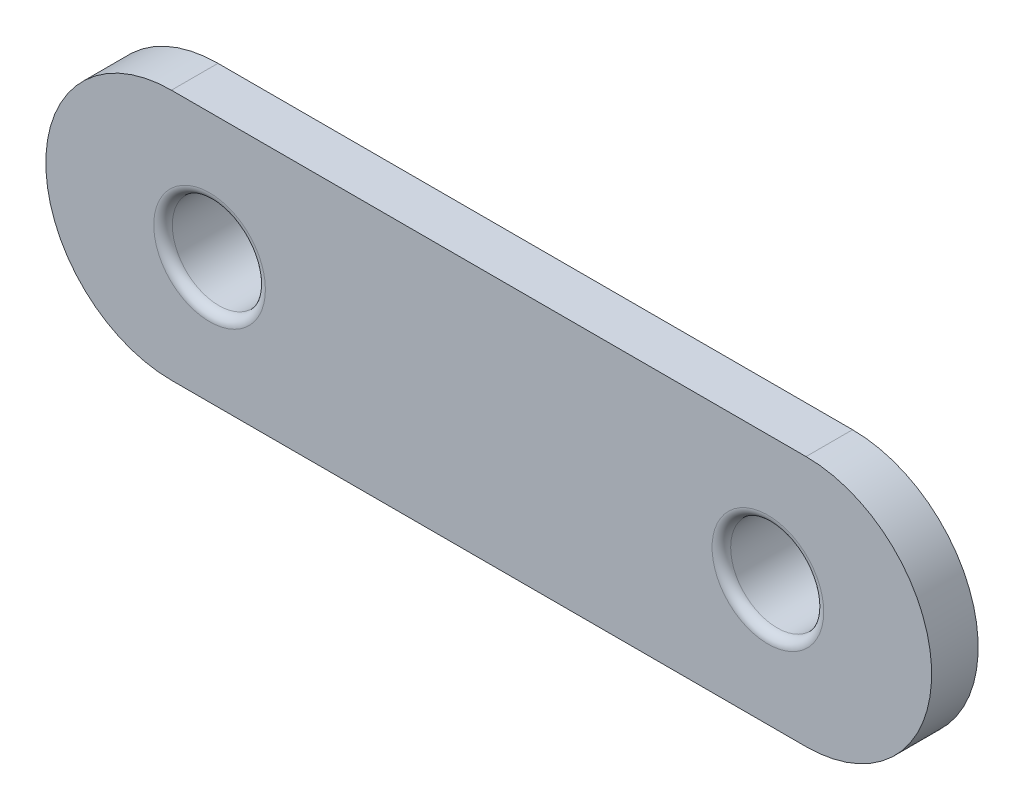
ISO-10303-21;
HEADER;
FILE_DESCRIPTION(('STEP AP214'),'2;1');
FILE_NAME('part.step','',(''),(''),'','','');
FILE_SCHEMA(('AUTOMOTIVE_DESIGN { 1 0 10303 214 1 1 1 1 }'));
ENDSEC;
DATA;
#1=APPLICATION_CONTEXT('core data for automotive mechanical design processes');
#2=APPLICATION_PROTOCOL_DEFINITION('international standard','automotive_design',2000,#1);
#3=PRODUCT_CONTEXT('',#1,'mechanical');
#4=PRODUCT('Part','Part','',(#3));
#5=PRODUCT_RELATED_PRODUCT_CATEGORY('part','',(#4));
#6=PRODUCT_DEFINITION_FORMATION('','',#4);
#7=PRODUCT_DEFINITION_CONTEXT('part definition',#1,'design');
#8=PRODUCT_DEFINITION('design','',#6,#7);
#9=PRODUCT_DEFINITION_SHAPE('','',#8);
#10=(LENGTH_UNIT() NAMED_UNIT(*) SI_UNIT(.MILLI.,.METRE.));
#11=(NAMED_UNIT(*) PLANE_ANGLE_UNIT() SI_UNIT($,.RADIAN.));
#12=(NAMED_UNIT(*) SI_UNIT($,.STERADIAN.) SOLID_ANGLE_UNIT());
#13=UNCERTAINTY_MEASURE_WITH_UNIT(LENGTH_MEASURE(1.E-05),#10,'distance_accuracy_value','');
#14=(GEOMETRIC_REPRESENTATION_CONTEXT(3) GLOBAL_UNCERTAINTY_ASSIGNED_CONTEXT((#13)) GLOBAL_UNIT_ASSIGNED_CONTEXT((#10,
#11,#12)) REPRESENTATION_CONTEXT('',''));
#15=CARTESIAN_POINT('',(0.,0.,0.));
#16=DIRECTION('',(0.,0.,1.));
#17=DIRECTION('',(1.,0.,0.));
#18=AXIS2_PLACEMENT_3D('',#15,#16,#17);
#19=CARTESIAN_POINT('',(-17.05,0.,0.));
#20=DIRECTION('',(0.,0.,1.));
#21=DIRECTION('',(1.,0.,0.));
#22=AXIS2_PLACEMENT_3D('',#19,#20,#21);
#23=PLANE('',#22);
#24=CARTESIAN_POINT('',(15.,0.,0.));
#25=DIRECTION('',(0.,0.,1.));
#26=DIRECTION('',(1.,0.,0.));
#27=AXIS2_PLACEMENT_3D('',#24,#25,#26);
#28=CIRCLE('',#27,3.5);
#29=CARTESIAN_POINT('',(18.5,0.,0.));
#30=VERTEX_POINT('',#29);
#31=EDGE_CURVE('E94',#30,#30,#28,.F.);
#32=ORIENTED_EDGE('',*,*,#31,.F.);
#33=EDGE_LOOP('',(#32));
#34=FACE_BOUND('',#33,.T.);
#35=CARTESIAN_POINT('',(-17.05,0.,0.));
#36=DIRECTION('',(0.,0.,1.));
#37=DIRECTION('',(1.,0.,0.));
#38=AXIS2_PLACEMENT_3D('',#35,#36,#37);
#39=CIRCLE('',#38,6.75);
#40=CARTESIAN_POINT('',(-17.05,6.75,0.));
#41=VERTEX_POINT('',#40);
#42=CARTESIAN_POINT('',(-17.05,-6.75,0.));
#43=VERTEX_POINT('',#42);
#44=EDGE_CURVE('E84',#41,#43,#39,.T.);
#45=ORIENTED_EDGE('',*,*,#44,.F.);
#46=DIRECTION('',(-1.,0.,0.));
#47=VECTOR('',#46,1.);
#48=CARTESIAN_POINT('',(-17.05,6.75,0.));
#49=LINE('',#48,#47);
#50=CARTESIAN_POINT('',(17.05,6.75,0.));
#51=VERTEX_POINT('',#50);
#52=EDGE_CURVE('E56',#51,#41,#49,.T.);
#53=ORIENTED_EDGE('',*,*,#52,.F.);
#54=CARTESIAN_POINT('',(17.05,0.,0.));
#55=DIRECTION('',(0.,0.,1.));
#56=DIRECTION('',(1.,0.,0.));
#57=AXIS2_PLACEMENT_3D('',#54,#55,#56);
#58=CIRCLE('',#57,6.75);
#59=CARTESIAN_POINT('',(17.05,-6.75,0.));
#60=VERTEX_POINT('',#59);
#61=EDGE_CURVE('E50',#60,#51,#58,.T.);
#62=ORIENTED_EDGE('',*,*,#61,.F.);
#63=DIRECTION('',(1.,0.,0.));
#64=VECTOR('',#63,1.);
#65=CARTESIAN_POINT('',(-17.05,-6.75,0.));
#66=LINE('',#65,#64);
#67=EDGE_CURVE('E74',#43,#60,#66,.T.);
#68=ORIENTED_EDGE('',*,*,#67,.F.);
#69=EDGE_LOOP('',(#45,#53,#62,#68));
#70=FACE_BOUND('',#69,.T.);
#71=CARTESIAN_POINT('',(-15.,0.,0.));
#72=DIRECTION('',(0.,0.,1.));
#73=DIRECTION('',(1.,0.,0.));
#74=AXIS2_PLACEMENT_3D('',#71,#72,#73);
#75=CIRCLE('',#74,3.5);
#76=CARTESIAN_POINT('',(-11.5,0.,0.));
#77=VERTEX_POINT('',#76);
#78=EDGE_CURVE('E97',#77,#77,#75,.F.);
#79=ORIENTED_EDGE('',*,*,#78,.F.);
#80=EDGE_LOOP('',(#79));
#81=FACE_BOUND('',#80,.T.);
#82=ADVANCED_FACE('F16',(#34,#70,#81),#23,.F.);
#83=CARTESIAN_POINT('',(-17.05,0.,2.5));
#84=DIRECTION('',(0.,0.,1.));
#85=DIRECTION('',(1.,0.,0.));
#86=AXIS2_PLACEMENT_3D('',#83,#84,#85);
#87=PLANE('',#86);
#88=CARTESIAN_POINT('',(15.,0.,2.5));
#89=DIRECTION('',(0.,0.,1.));
#90=DIRECTION('',(1.,0.,0.));
#91=AXIS2_PLACEMENT_3D('',#88,#89,#90);
#92=CIRCLE('',#91,3.);
#93=CARTESIAN_POINT('',(18.,0.,2.5));
#94=VERTEX_POINT('',#93);
#95=EDGE_CURVE('E25',#94,#94,#92,.F.);
#96=ORIENTED_EDGE('',*,*,#95,.T.);
#97=EDGE_LOOP('',(#96));
#98=FACE_BOUND('',#97,.T.);
#99=CARTESIAN_POINT('',(-15.,0.,2.5));
#100=DIRECTION('',(0.,0.,1.));
#101=DIRECTION('',(1.,0.,0.));
#102=AXIS2_PLACEMENT_3D('',#99,#100,#101);
#103=CIRCLE('',#102,3.);
#104=CARTESIAN_POINT('',(-12.,0.,2.5));
#105=VERTEX_POINT('',#104);
#106=EDGE_CURVE('E103',#105,#105,#103,.F.);
#107=ORIENTED_EDGE('',*,*,#106,.T.);
#108=EDGE_LOOP('',(#107));
#109=FACE_BOUND('',#108,.T.);
#110=CARTESIAN_POINT('',(-17.05,0.,2.5));
#111=DIRECTION('',(0.,0.,1.));
#112=DIRECTION('',(1.,0.,0.));
#113=AXIS2_PLACEMENT_3D('',#110,#111,#112);
#114=CIRCLE('',#113,6.75);
#115=CARTESIAN_POINT('',(-17.05,6.75,2.5));
#116=VERTEX_POINT('',#115);
#117=CARTESIAN_POINT('',(-17.05,-6.75,2.5));
#118=VERTEX_POINT('',#117);
#119=EDGE_CURVE('E69',#116,#118,#114,.T.);
#120=ORIENTED_EDGE('',*,*,#119,.T.);
#121=DIRECTION('',(1.,0.,0.));
#122=VECTOR('',#121,1.);
#123=CARTESIAN_POINT('',(-17.05,-6.75,2.5));
#124=LINE('',#123,#122);
#125=CARTESIAN_POINT('',(17.05,-6.75,2.5));
#126=VERTEX_POINT('',#125);
#127=EDGE_CURVE('E64',#118,#126,#124,.T.);
#128=ORIENTED_EDGE('',*,*,#127,.T.);
#129=CARTESIAN_POINT('',(17.05,0.,2.5));
#130=DIRECTION('',(0.,0.,1.));
#131=DIRECTION('',(1.,0.,0.));
#132=AXIS2_PLACEMENT_3D('',#129,#130,#131);
#133=CIRCLE('',#132,6.75);
#134=CARTESIAN_POINT('',(17.05,6.75,2.5));
#135=VERTEX_POINT('',#134);
#136=EDGE_CURVE('E67',#126,#135,#133,.T.);
#137=ORIENTED_EDGE('',*,*,#136,.T.);
#138=DIRECTION('',(-1.,0.,0.));
#139=VECTOR('',#138,1.);
#140=CARTESIAN_POINT('',(-17.05,6.75,2.5));
#141=LINE('',#140,#139);
#142=EDGE_CURVE('E33',#135,#116,#141,.T.);
#143=ORIENTED_EDGE('',*,*,#142,.T.);
#144=EDGE_LOOP('',(#120,#128,#137,#143));
#145=FACE_BOUND('',#144,.T.);
#146=ADVANCED_FACE('F65',(#98,#109,#145),#87,.T.);
#147=CARTESIAN_POINT('',(-17.05,0.,2.5));
#148=DIRECTION('',(0.,0.,-1.));
#149=DIRECTION('',(-1.,0.,0.));
#150=AXIS2_PLACEMENT_3D('',#147,#148,#149);
#151=CYLINDRICAL_SURFACE('',#150,6.75);
#152=ORIENTED_EDGE('',*,*,#44,.T.);
#153=DIRECTION('',(0.,0.,-1.));
#154=VECTOR('',#153,1.);
#155=CARTESIAN_POINT('',(-17.05,-6.75,2.5));
#156=LINE('',#155,#154);
#157=EDGE_CURVE('E75',#118,#43,#156,.T.);
#158=ORIENTED_EDGE('',*,*,#157,.F.);
#159=ORIENTED_EDGE('',*,*,#119,.F.);
#160=DIRECTION('',(0.,0.,-1.));
#161=VECTOR('',#160,1.);
#162=CARTESIAN_POINT('',(-17.05,6.75,2.5));
#163=LINE('',#162,#161);
#164=EDGE_CURVE('E80',#116,#41,#163,.T.);
#165=ORIENTED_EDGE('',*,*,#164,.T.);
#166=EDGE_LOOP('',(#152,#158,#159,#165));
#167=FACE_BOUND('',#166,.T.);
#168=ADVANCED_FACE('F158',(#167),#151,.T.);
#169=CARTESIAN_POINT('',(-17.05,-6.75,2.5));
#170=DIRECTION('',(0.,1.,0.));
#171=DIRECTION('',(0.,0.,1.));
#172=AXIS2_PLACEMENT_3D('',#169,#170,#171);
#173=PLANE('',#172);
#174=ORIENTED_EDGE('',*,*,#67,.T.);
#175=DIRECTION('',(0.,0.,-1.));
#176=VECTOR('',#175,1.);
#177=CARTESIAN_POINT('',(17.05,-6.75,2.5));
#178=LINE('',#177,#176);
#179=EDGE_CURVE('E72',#126,#60,#178,.T.);
#180=ORIENTED_EDGE('',*,*,#179,.F.);
#181=ORIENTED_EDGE('',*,*,#127,.F.);
#182=ORIENTED_EDGE('',*,*,#157,.T.);
#183=EDGE_LOOP('',(#174,#180,#181,#182));
#184=FACE_BOUND('',#183,.T.);
#185=ADVANCED_FACE('F73',(#184),#173,.F.);
#186=CARTESIAN_POINT('',(17.05,0.,2.5));
#187=DIRECTION('',(0.,0.,-1.));
#188=DIRECTION('',(-1.,0.,0.));
#189=AXIS2_PLACEMENT_3D('',#186,#187,#188);
#190=CYLINDRICAL_SURFACE('',#189,6.75);
#191=ORIENTED_EDGE('',*,*,#61,.T.);
#192=DIRECTION('',(0.,0.,-1.));
#193=VECTOR('',#192,1.);
#194=CARTESIAN_POINT('',(17.05,6.75,2.5));
#195=LINE('',#194,#193);
#196=EDGE_CURVE('E76',#135,#51,#195,.T.);
#197=ORIENTED_EDGE('',*,*,#196,.F.);
#198=ORIENTED_EDGE('',*,*,#136,.F.);
#199=ORIENTED_EDGE('',*,*,#179,.T.);
#200=EDGE_LOOP('',(#191,#197,#198,#199));
#201=FACE_BOUND('',#200,.T.);
#202=ADVANCED_FACE('F78',(#201),#190,.T.);
#203=CARTESIAN_POINT('',(-17.05,6.75,2.5));
#204=DIRECTION('',(0.,-1.,0.));
#205=DIRECTION('',(1.,0.,0.));
#206=AXIS2_PLACEMENT_3D('',#203,#204,#205);
#207=PLANE('',#206);
#208=ORIENTED_EDGE('',*,*,#52,.T.);
#209=ORIENTED_EDGE('',*,*,#164,.F.);
#210=ORIENTED_EDGE('',*,*,#142,.F.);
#211=ORIENTED_EDGE('',*,*,#196,.T.);
#212=EDGE_LOOP('',(#208,#209,#210,#211));
#213=FACE_BOUND('',#212,.T.);
#214=ADVANCED_FACE('F164',(#213),#207,.F.);
#215=CARTESIAN_POINT('',(-15.,0.,2.5));
#216=DIRECTION('',(0.,0.,-1.));
#217=DIRECTION('',(-1.,0.,0.));
#218=AXIS2_PLACEMENT_3D('',#215,#216,#217);
#219=CYLINDRICAL_SURFACE('',#218,2.5);
#220=CARTESIAN_POINT('',(-15.,0.,2.));
#221=DIRECTION('',(0.,0.,1.));
#222=DIRECTION('',(1.,0.,0.));
#223=AXIS2_PLACEMENT_3D('',#220,#221,#222);
#224=CIRCLE('',#223,2.5);
#225=CARTESIAN_POINT('',(-12.5,0.,2.));
#226=VERTEX_POINT('',#225);
#227=EDGE_CURVE('E10',#226,#226,#224,.T.);
#228=ORIENTED_EDGE('',*,*,#227,.T.);
#229=EDGE_LOOP('',(#228));
#230=FACE_BOUND('',#229,.T.);
#231=CARTESIAN_POINT('',(-15.,0.,-2.8));
#232=DIRECTION('',(0.,0.,-1.));
#233=DIRECTION('',(-1.,0.,0.));
#234=AXIS2_PLACEMENT_3D('',#231,#232,#233);
#235=CIRCLE('',#234,2.5);
#236=CARTESIAN_POINT('',(-17.5,0.,-2.8));
#237=VERTEX_POINT('',#236);
#238=EDGE_CURVE('E131',#237,#237,#235,.T.);
#239=ORIENTED_EDGE('',*,*,#238,.T.);
#240=EDGE_LOOP('',(#239));
#241=FACE_BOUND('',#240,.T.);
#242=ADVANCED_FACE('F120',(#230,#241),#219,.F.);
#243=CARTESIAN_POINT('',(15.,0.,2.5));
#244=DIRECTION('',(0.,0.,-1.));
#245=DIRECTION('',(-1.,0.,0.));
#246=AXIS2_PLACEMENT_3D('',#243,#244,#245);
#247=CYLINDRICAL_SURFACE('',#246,2.5);
#248=CARTESIAN_POINT('',(15.,0.,2.));
#249=DIRECTION('',(0.,0.,1.));
#250=DIRECTION('',(1.,0.,0.));
#251=AXIS2_PLACEMENT_3D('',#248,#249,#250);
#252=CIRCLE('',#251,2.5);
#253=CARTESIAN_POINT('',(17.5,0.,2.));
#254=VERTEX_POINT('',#253);
#255=EDGE_CURVE('E100',#254,#254,#252,.T.);
#256=ORIENTED_EDGE('',*,*,#255,.T.);
#257=EDGE_LOOP('',(#256));
#258=FACE_BOUND('',#257,.T.);
#259=CARTESIAN_POINT('',(15.,0.,-2.8));
#260=DIRECTION('',(0.,0.,-1.));
#261=DIRECTION('',(-1.,0.,0.));
#262=AXIS2_PLACEMENT_3D('',#259,#260,#261);
#263=CIRCLE('',#262,2.5);
#264=CARTESIAN_POINT('',(12.5,0.,-2.8));
#265=VERTEX_POINT('',#264);
#266=EDGE_CURVE('E124',#265,#265,#263,.T.);
#267=ORIENTED_EDGE('',*,*,#266,.T.);
#268=EDGE_LOOP('',(#267));
#269=FACE_BOUND('',#268,.T.);
#270=ADVANCED_FACE('F116',(#258,#269),#247,.F.);
#271=CARTESIAN_POINT('',(15.,0.,-2.8));
#272=DIRECTION('',(0.,0.,-1.));
#273=DIRECTION('',(-1.,0.,0.));
#274=AXIS2_PLACEMENT_3D('',#271,#272,#273);
#275=PLANE('',#274);
#276=CARTESIAN_POINT('',(15.,0.,-2.8));
#277=DIRECTION('',(0.,0.,-1.));
#278=DIRECTION('',(-1.,0.,0.));
#279=AXIS2_PLACEMENT_3D('',#276,#277,#278);
#280=CIRCLE('',#279,3.5);
#281=CARTESIAN_POINT('',(11.5,0.,-2.8));
#282=VERTEX_POINT('',#281);
#283=EDGE_CURVE('E87',#282,#282,#280,.T.);
#284=ORIENTED_EDGE('',*,*,#283,.T.);
#285=EDGE_LOOP('',(#284));
#286=FACE_BOUND('',#285,.T.);
#287=ORIENTED_EDGE('',*,*,#266,.F.);
#288=EDGE_LOOP('',(#287));
#289=FACE_BOUND('',#288,.T.);
#290=ADVANCED_FACE('F119',(#286,#289),#275,.T.);
#291=CARTESIAN_POINT('',(15.,0.,-2.8));
#292=DIRECTION('',(0.,0.,1.));
#293=DIRECTION('',(1.,0.,0.));
#294=AXIS2_PLACEMENT_3D('',#291,#292,#293);
#295=CYLINDRICAL_SURFACE('',#294,3.5);
#296=ORIENTED_EDGE('',*,*,#283,.F.);
#297=EDGE_LOOP('',(#296));
#298=FACE_BOUND('',#297,.T.);
#299=ORIENTED_EDGE('',*,*,#31,.T.);
#300=EDGE_LOOP('',(#299));
#301=FACE_BOUND('',#300,.T.);
#302=ADVANCED_FACE('F140',(#298,#301),#295,.T.);
#303=CARTESIAN_POINT('',(-15.,0.,-2.8));
#304=DIRECTION('',(0.,0.,-1.));
#305=DIRECTION('',(-1.,0.,0.));
#306=AXIS2_PLACEMENT_3D('',#303,#304,#305);
#307=PLANE('',#306);
#308=CARTESIAN_POINT('',(-15.,0.,-2.8));
#309=DIRECTION('',(0.,0.,-1.));
#310=DIRECTION('',(-1.,0.,0.));
#311=AXIS2_PLACEMENT_3D('',#308,#309,#310);
#312=CIRCLE('',#311,3.5);
#313=CARTESIAN_POINT('',(-18.5,0.,-2.8));
#314=VERTEX_POINT('',#313);
#315=EDGE_CURVE('E126',#314,#314,#312,.T.);
#316=ORIENTED_EDGE('',*,*,#315,.T.);
#317=EDGE_LOOP('',(#316));
#318=FACE_BOUND('',#317,.T.);
#319=ORIENTED_EDGE('',*,*,#238,.F.);
#320=EDGE_LOOP('',(#319));
#321=FACE_BOUND('',#320,.T.);
#322=ADVANCED_FACE('F138',(#318,#321),#307,.T.);
#323=CARTESIAN_POINT('',(-15.,0.,-2.8));
#324=DIRECTION('',(0.,0.,1.));
#325=DIRECTION('',(1.,0.,0.));
#326=AXIS2_PLACEMENT_3D('',#323,#324,#325);
#327=CYLINDRICAL_SURFACE('',#326,3.5);
#328=ORIENTED_EDGE('',*,*,#315,.F.);
#329=EDGE_LOOP('',(#328));
#330=FACE_BOUND('',#329,.T.);
#331=ORIENTED_EDGE('',*,*,#78,.T.);
#332=EDGE_LOOP('',(#331));
#333=FACE_BOUND('',#332,.T.);
#334=ADVANCED_FACE('F113',(#330,#333),#327,.T.);
#335=CARTESIAN_POINT('',(15.,0.,2.));
#336=DIRECTION('',(0.,0.,1.));
#337=DIRECTION('',(1.,0.,0.));
#338=AXIS2_PLACEMENT_3D('',#335,#336,#337);
#339=TOROIDAL_SURFACE('',#338,3.,0.5);
#340=ORIENTED_EDGE('',*,*,#95,.F.);
#341=EDGE_LOOP('',(#340));
#342=FACE_BOUND('',#341,.T.);
#343=ORIENTED_EDGE('',*,*,#255,.F.);
#344=EDGE_LOOP('',(#343));
#345=FACE_BOUND('',#344,.T.);
#346=ADVANCED_FACE('F110',(#342,#345),#339,.T.);
#347=CARTESIAN_POINT('',(-15.,0.,2.));
#348=DIRECTION('',(0.,0.,1.));
#349=DIRECTION('',(1.,0.,0.));
#350=AXIS2_PLACEMENT_3D('',#347,#348,#349);
#351=TOROIDAL_SURFACE('',#350,3.,0.5);
#352=ORIENTED_EDGE('',*,*,#106,.F.);
#353=EDGE_LOOP('',(#352));
#354=FACE_BOUND('',#353,.T.);
#355=ORIENTED_EDGE('',*,*,#227,.F.);
#356=EDGE_LOOP('',(#355));
#357=FACE_BOUND('',#356,.T.);
#358=ADVANCED_FACE('F18',(#354,#357),#351,.T.);
#359=CLOSED_SHELL('',(#82,#146,#168,#185,#202,#214,#242,#270,#290,#302,#322,#334,#346,#358));
#360=MANIFOLD_SOLID_BREP('B1',#359);
#361=ADVANCED_BREP_SHAPE_REPRESENTATION('',(#18,#360),#14);
#362=SHAPE_DEFINITION_REPRESENTATION(#9,#361);
ENDSEC;
END-ISO-10303-21;
